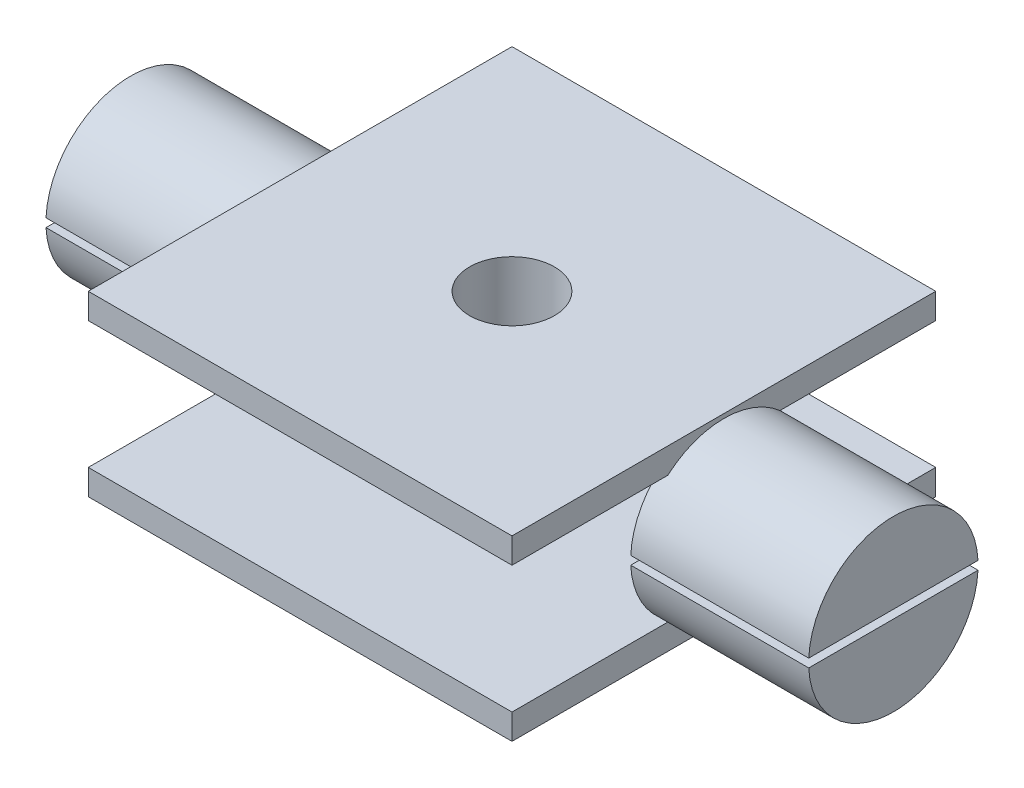
ISO-10303-21;
HEADER;
FILE_DESCRIPTION(('STEP AP214'),'2;1');
FILE_NAME('part.step','',(''),(''),'','','');
FILE_SCHEMA(('AUTOMOTIVE_DESIGN { 1 0 10303 214 1 1 1 1 }'));
ENDSEC;
DATA;
#1=APPLICATION_CONTEXT('core data for automotive mechanical design processes');
#2=APPLICATION_PROTOCOL_DEFINITION('international standard','automotive_design',2000,#1);
#3=PRODUCT_CONTEXT('',#1,'mechanical');
#4=PRODUCT('Part','Part','',(#3));
#5=PRODUCT_RELATED_PRODUCT_CATEGORY('part','',(#4));
#6=PRODUCT_DEFINITION_FORMATION('','',#4);
#7=PRODUCT_DEFINITION_CONTEXT('part definition',#1,'design');
#8=PRODUCT_DEFINITION('design','',#6,#7);
#9=PRODUCT_DEFINITION_SHAPE('','',#8);
#10=(LENGTH_UNIT() NAMED_UNIT(*) SI_UNIT(.MILLI.,.METRE.));
#11=(NAMED_UNIT(*) PLANE_ANGLE_UNIT() SI_UNIT($,.RADIAN.));
#12=(NAMED_UNIT(*) SI_UNIT($,.STERADIAN.) SOLID_ANGLE_UNIT());
#13=UNCERTAINTY_MEASURE_WITH_UNIT(LENGTH_MEASURE(1.E-05),#10,'distance_accuracy_value','');
#14=(GEOMETRIC_REPRESENTATION_CONTEXT(3) GLOBAL_UNCERTAINTY_ASSIGNED_CONTEXT((#13)) GLOBAL_UNIT_ASSIGNED_CONTEXT((#10,
#11,#12)) REPRESENTATION_CONTEXT('',''));
#15=CARTESIAN_POINT('',(0.,0.,0.));
#16=DIRECTION('',(0.,0.,1.));
#17=DIRECTION('',(1.,0.,0.));
#18=AXIS2_PLACEMENT_3D('',#15,#16,#17);
#19=CARTESIAN_POINT('',(0.,15.,0.));
#20=DIRECTION('',(0.,-1.,0.));
#21=DIRECTION('',(0.,0.,-1.));
#22=AXIS2_PLACEMENT_3D('',#19,#20,#21);
#23=CYLINDRICAL_SURFACE('',#22,10.);
#24=CARTESIAN_POINT('',(0.,0.,0.));
#25=DIRECTION('',(0.,1.,0.));
#26=DIRECTION('',(0.,0.,1.));
#27=AXIS2_PLACEMENT_3D('',#24,#25,#26);
#28=CIRCLE('',#27,10.);
#29=CARTESIAN_POINT('',(0.,0.,10.));
#30=VERTEX_POINT('',#29);
#31=EDGE_CURVE('E374',#30,#30,#28,.T.);
#32=ORIENTED_EDGE('',*,*,#31,.T.);
#33=EDGE_LOOP('',(#32));
#34=FACE_BOUND('',#33,.T.);
#35=CARTESIAN_POINT('',(0.,15.,0.));
#36=DIRECTION('',(0.,1.,0.));
#37=DIRECTION('',(0.,0.,1.));
#38=AXIS2_PLACEMENT_3D('',#35,#36,#37);
#39=CIRCLE('',#38,10.);
#40=CARTESIAN_POINT('',(0.,15.,10.));
#41=VERTEX_POINT('',#40);
#42=EDGE_CURVE('E375',#41,#41,#39,.T.);
#43=ORIENTED_EDGE('',*,*,#42,.F.);
#44=EDGE_LOOP('',(#43));
#45=FACE_BOUND('',#44,.T.);
#46=ADVANCED_FACE('F38',(#34,#45),#23,.T.);
#47=CARTESIAN_POINT('',(-25.,-3.,25.));
#48=DIRECTION('',(0.,0.,-1.));
#49=DIRECTION('',(-1.,0.,0.));
#50=AXIS2_PLACEMENT_3D('',#47,#48,#49);
#51=PLANE('',#50);
#52=DIRECTION('',(-1.,0.,0.));
#53=VECTOR('',#52,1.);
#54=CARTESIAN_POINT('',(-25.,-3.,25.));
#55=LINE('',#54,#53);
#56=CARTESIAN_POINT('',(25.,-3.,25.));
#57=VERTEX_POINT('',#56);
#58=CARTESIAN_POINT('',(-25.,-3.,25.));
#59=VERTEX_POINT('',#58);
#60=EDGE_CURVE('E355',#57,#59,#55,.T.);
#61=ORIENTED_EDGE('',*,*,#60,.F.);
#62=DIRECTION('',(0.,1.,0.));
#63=VECTOR('',#62,1.);
#64=CARTESIAN_POINT('',(25.,-3.,25.));
#65=LINE('',#64,#63);
#66=CARTESIAN_POINT('',(25.,0.,25.));
#67=VERTEX_POINT('',#66);
#68=EDGE_CURVE('E518',#57,#67,#65,.T.);
#69=ORIENTED_EDGE('',*,*,#68,.T.);
#70=DIRECTION('',(-1.,0.,0.));
#71=VECTOR('',#70,1.);
#72=CARTESIAN_POINT('',(-25.,0.,25.));
#73=LINE('',#72,#71);
#74=CARTESIAN_POINT('',(-25.,0.,25.));
#75=VERTEX_POINT('',#74);
#76=EDGE_CURVE('E354',#67,#75,#73,.T.);
#77=ORIENTED_EDGE('',*,*,#76,.T.);
#78=DIRECTION('',(0.,1.,0.));
#79=VECTOR('',#78,1.);
#80=CARTESIAN_POINT('',(-25.,-3.,25.));
#81=LINE('',#80,#79);
#82=EDGE_CURVE('E371',#59,#75,#81,.T.);
#83=ORIENTED_EDGE('',*,*,#82,.F.);
#84=EDGE_LOOP('',(#61,#69,#77,#83));
#85=FACE_BOUND('',#84,.T.);
#86=ADVANCED_FACE('F424',(#85),#51,.F.);
#87=CARTESIAN_POINT('',(-25.,-3.,-25.));
#88=DIRECTION('',(0.,0.,1.));
#89=DIRECTION('',(1.,0.,0.));
#90=AXIS2_PLACEMENT_3D('',#87,#88,#89);
#91=PLANE('',#90);
#92=DIRECTION('',(1.,0.,0.));
#93=VECTOR('',#92,1.);
#94=CARTESIAN_POINT('',(-25.,0.,-25.));
#95=LINE('',#94,#93);
#96=CARTESIAN_POINT('',(-25.,0.,-25.));
#97=VERTEX_POINT('',#96);
#98=CARTESIAN_POINT('',(25.,0.,-25.));
#99=VERTEX_POINT('',#98);
#100=EDGE_CURVE('E358',#97,#99,#95,.T.);
#101=ORIENTED_EDGE('',*,*,#100,.T.);
#102=DIRECTION('',(0.,1.,0.));
#103=VECTOR('',#102,1.);
#104=CARTESIAN_POINT('',(25.,-3.,-25.));
#105=LINE('',#104,#103);
#106=CARTESIAN_POINT('',(25.,-3.,-25.));
#107=VERTEX_POINT('',#106);
#108=EDGE_CURVE('E508',#107,#99,#105,.T.);
#109=ORIENTED_EDGE('',*,*,#108,.F.);
#110=DIRECTION('',(1.,0.,0.));
#111=VECTOR('',#110,1.);
#112=CARTESIAN_POINT('',(-25.,-3.,-25.));
#113=LINE('',#112,#111);
#114=CARTESIAN_POINT('',(-25.,-3.,-25.));
#115=VERTEX_POINT('',#114);
#116=EDGE_CURVE('E360',#115,#107,#113,.T.);
#117=ORIENTED_EDGE('',*,*,#116,.F.);
#118=DIRECTION('',(0.,1.,0.));
#119=VECTOR('',#118,1.);
#120=CARTESIAN_POINT('',(-25.,-3.,-25.));
#121=LINE('',#120,#119);
#122=EDGE_CURVE('E362',#115,#97,#121,.T.);
#123=ORIENTED_EDGE('',*,*,#122,.T.);
#124=EDGE_LOOP('',(#101,#109,#117,#123));
#125=FACE_BOUND('',#124,.T.);
#126=ADVANCED_FACE('F429',(#125),#91,.F.);
#127=CARTESIAN_POINT('',(0.,-3.,0.));
#128=DIRECTION('',(0.,1.,0.));
#129=DIRECTION('',(0.,0.,1.));
#130=AXIS2_PLACEMENT_3D('',#127,#128,#129);
#131=PLANE('',#130);
#132=CARTESIAN_POINT('',(0.,-3.,0.));
#133=DIRECTION('',(0.,1.,0.));
#134=DIRECTION('',(0.,0.,1.));
#135=AXIS2_PLACEMENT_3D('',#132,#133,#134);
#136=CIRCLE('',#135,5.);
#137=CARTESIAN_POINT('',(0.,-3.,5.));
#138=VERTEX_POINT('',#137);
#139=EDGE_CURVE('E293',#138,#138,#136,.T.);
#140=ORIENTED_EDGE('',*,*,#139,.T.);
#141=EDGE_LOOP('',(#140));
#142=FACE_BOUND('',#141,.T.);
#143=DIRECTION('',(0.,0.,-1.));
#144=VECTOR('',#143,1.);
#145=CARTESIAN_POINT('',(25.,-3.,-25.));
#146=LINE('',#145,#144);
#147=EDGE_CURVE('E512',#57,#107,#146,.T.);
#148=ORIENTED_EDGE('',*,*,#147,.F.);
#149=ORIENTED_EDGE('',*,*,#60,.T.);
#150=DIRECTION('',(0.,0.,-1.));
#151=VECTOR('',#150,1.);
#152=CARTESIAN_POINT('',(-25.,-3.,-25.));
#153=LINE('',#152,#151);
#154=EDGE_CURVE('E357',#59,#115,#153,.T.);
#155=ORIENTED_EDGE('',*,*,#154,.T.);
#156=ORIENTED_EDGE('',*,*,#116,.T.);
#157=EDGE_LOOP('',(#148,#149,#155,#156));
#158=FACE_BOUND('',#157,.T.);
#159=ADVANCED_FACE('F468',(#142,#158),#131,.F.);
#160=CARTESIAN_POINT('',(0.,0.,0.));
#161=DIRECTION('',(0.,1.,0.));
#162=DIRECTION('',(0.,0.,1.));
#163=AXIS2_PLACEMENT_3D('',#160,#161,#162);
#164=PLANE('',#163);
#165=ORIENTED_EDGE('',*,*,#31,.F.);
#166=EDGE_LOOP('',(#165));
#167=FACE_BOUND('',#166,.T.);
#168=ORIENTED_EDGE('',*,*,#76,.F.);
#169=DIRECTION('',(0.,0.,-1.));
#170=VECTOR('',#169,1.);
#171=CARTESIAN_POINT('',(25.,0.,-25.));
#172=LINE('',#171,#170);
#173=CARTESIAN_POINT('',(25.,0.,6.61437827766148));
#174=VERTEX_POINT('',#173);
#175=EDGE_CURVE('E519',#67,#174,#172,.T.);
#176=ORIENTED_EDGE('',*,*,#175,.T.);
#177=DIRECTION('',(1.,0.,0.));
#178=VECTOR('',#177,1.);
#179=CARTESIAN_POINT('',(24.,0.,6.61437827766148));
#180=LINE('',#179,#178);
#181=CARTESIAN_POINT('',(24.,0.,6.61437827766148));
#182=VERTEX_POINT('',#181);
#183=EDGE_CURVE('E578',#174,#182,#180,.F.);
#184=ORIENTED_EDGE('',*,*,#183,.T.);
#185=DIRECTION('',(0.,0.,1.));
#186=VECTOR('',#185,1.);
#187=CARTESIAN_POINT('',(24.,0.,0.));
#188=LINE('',#187,#186);
#189=CARTESIAN_POINT('',(24.,0.,-6.61437827766148));
#190=VERTEX_POINT('',#189);
#191=EDGE_CURVE('E573',#190,#182,#188,.T.);
#192=ORIENTED_EDGE('',*,*,#191,.F.);
#193=DIRECTION('',(1.,0.,0.));
#194=VECTOR('',#193,1.);
#195=CARTESIAN_POINT('',(24.,0.,-6.61437827766148));
#196=LINE('',#195,#194);
#197=CARTESIAN_POINT('',(25.,0.,-6.61437827766148));
#198=VERTEX_POINT('',#197);
#199=EDGE_CURVE('E583',#190,#198,#196,.T.);
#200=ORIENTED_EDGE('',*,*,#199,.T.);
#201=EDGE_CURVE('E522',#198,#99,#172,.T.);
#202=ORIENTED_EDGE('',*,*,#201,.T.);
#203=ORIENTED_EDGE('',*,*,#100,.F.);
#204=DIRECTION('',(0.,0.,-1.));
#205=VECTOR('',#204,1.);
#206=CARTESIAN_POINT('',(-25.,0.,-25.));
#207=LINE('',#206,#205);
#208=CARTESIAN_POINT('',(-25.,0.,-6.61437827766148));
#209=VERTEX_POINT('',#208);
#210=EDGE_CURVE('E364',#209,#97,#207,.T.);
#211=ORIENTED_EDGE('',*,*,#210,.F.);
#212=DIRECTION('',(-1.,0.,0.));
#213=VECTOR('',#212,1.);
#214=CARTESIAN_POINT('',(-24.,0.,-6.61437827766148));
#215=LINE('',#214,#213);
#216=CARTESIAN_POINT('',(-24.,0.,-6.61437827766148));
#217=VERTEX_POINT('',#216);
#218=EDGE_CURVE('E332',#217,#209,#215,.T.);
#219=ORIENTED_EDGE('',*,*,#218,.F.);
#220=DIRECTION('',(0.,0.,1.));
#221=VECTOR('',#220,1.);
#222=CARTESIAN_POINT('',(-24.,0.,0.));
#223=LINE('',#222,#221);
#224=CARTESIAN_POINT('',(-24.,0.,6.61437827766148));
#225=VERTEX_POINT('',#224);
#226=EDGE_CURVE('E320',#217,#225,#223,.T.);
#227=ORIENTED_EDGE('',*,*,#226,.T.);
#228=DIRECTION('',(-1.,0.,0.));
#229=VECTOR('',#228,1.);
#230=CARTESIAN_POINT('',(-24.,0.,6.61437827766148));
#231=LINE('',#230,#229);
#232=CARTESIAN_POINT('',(-25.,0.,6.61437827766148));
#233=VERTEX_POINT('',#232);
#234=EDGE_CURVE('E326',#233,#225,#231,.F.);
#235=ORIENTED_EDGE('',*,*,#234,.F.);
#236=EDGE_CURVE('E365',#75,#233,#207,.T.);
#237=ORIENTED_EDGE('',*,*,#236,.F.);
#238=EDGE_LOOP('',(#168,#176,#184,#192,#200,#202,#203,#211,#219,#227,#235,#237));
#239=FACE_BOUND('',#238,.T.);
#240=ADVANCED_FACE('F466',(#167,#239),#164,.T.);
#241=CARTESIAN_POINT('',(-25.,18.,-25.));
#242=DIRECTION('',(0.,0.,1.));
#243=DIRECTION('',(1.,0.,0.));
#244=AXIS2_PLACEMENT_3D('',#241,#242,#243);
#245=PLANE('',#244);
#246=DIRECTION('',(-1.,0.,0.));
#247=VECTOR('',#246,1.);
#248=CARTESIAN_POINT('',(-25.,18.,-25.));
#249=LINE('',#248,#247);
#250=CARTESIAN_POINT('',(25.,18.,-25.));
#251=VERTEX_POINT('',#250);
#252=CARTESIAN_POINT('',(-25.,18.,-25.));
#253=VERTEX_POINT('',#252);
#254=EDGE_CURVE('E335',#251,#253,#249,.T.);
#255=ORIENTED_EDGE('',*,*,#254,.F.);
#256=DIRECTION('',(0.,-1.,0.));
#257=VECTOR('',#256,1.);
#258=CARTESIAN_POINT('',(25.,18.,-25.));
#259=LINE('',#258,#257);
#260=CARTESIAN_POINT('',(25.,15.,-25.));
#261=VERTEX_POINT('',#260);
#262=EDGE_CURVE('E525',#251,#261,#259,.T.);
#263=ORIENTED_EDGE('',*,*,#262,.T.);
#264=DIRECTION('',(-1.,0.,0.));
#265=VECTOR('',#264,1.);
#266=CARTESIAN_POINT('',(-25.,15.,-25.));
#267=LINE('',#266,#265);
#268=CARTESIAN_POINT('',(-25.,15.,-25.));
#269=VERTEX_POINT('',#268);
#270=EDGE_CURVE('E334',#261,#269,#267,.T.);
#271=ORIENTED_EDGE('',*,*,#270,.T.);
#272=DIRECTION('',(0.,-1.,0.));
#273=VECTOR('',#272,1.);
#274=CARTESIAN_POINT('',(-25.,18.,-25.));
#275=LINE('',#274,#273);
#276=EDGE_CURVE('E351',#253,#269,#275,.T.);
#277=ORIENTED_EDGE('',*,*,#276,.F.);
#278=EDGE_LOOP('',(#255,#263,#271,#277));
#279=FACE_BOUND('',#278,.T.);
#280=ADVANCED_FACE('F456',(#279),#245,.F.);
#281=CARTESIAN_POINT('',(-25.,18.,25.));
#282=DIRECTION('',(0.,0.,-1.));
#283=DIRECTION('',(-1.,0.,0.));
#284=AXIS2_PLACEMENT_3D('',#281,#282,#283);
#285=PLANE('',#284);
#286=DIRECTION('',(1.,0.,0.));
#287=VECTOR('',#286,1.);
#288=CARTESIAN_POINT('',(-25.,15.,25.));
#289=LINE('',#288,#287);
#290=CARTESIAN_POINT('',(-25.,15.,25.));
#291=VERTEX_POINT('',#290);
#292=CARTESIAN_POINT('',(25.,15.,25.));
#293=VERTEX_POINT('',#292);
#294=EDGE_CURVE('E338',#291,#293,#289,.T.);
#295=ORIENTED_EDGE('',*,*,#294,.T.);
#296=DIRECTION('',(0.,-1.,0.));
#297=VECTOR('',#296,1.);
#298=CARTESIAN_POINT('',(25.,18.,25.));
#299=LINE('',#298,#297);
#300=CARTESIAN_POINT('',(25.,18.,25.));
#301=VERTEX_POINT('',#300);
#302=EDGE_CURVE('E590',#301,#293,#299,.T.);
#303=ORIENTED_EDGE('',*,*,#302,.F.);
#304=DIRECTION('',(1.,0.,0.));
#305=VECTOR('',#304,1.);
#306=CARTESIAN_POINT('',(-25.,18.,25.));
#307=LINE('',#306,#305);
#308=CARTESIAN_POINT('',(-25.,18.,25.));
#309=VERTEX_POINT('',#308);
#310=EDGE_CURVE('E340',#309,#301,#307,.T.);
#311=ORIENTED_EDGE('',*,*,#310,.F.);
#312=DIRECTION('',(0.,-1.,0.));
#313=VECTOR('',#312,1.);
#314=CARTESIAN_POINT('',(-25.,18.,25.));
#315=LINE('',#314,#313);
#316=EDGE_CURVE('E342',#309,#291,#315,.T.);
#317=ORIENTED_EDGE('',*,*,#316,.T.);
#318=EDGE_LOOP('',(#295,#303,#311,#317));
#319=FACE_BOUND('',#318,.T.);
#320=ADVANCED_FACE('F448',(#319),#285,.F.);
#321=CARTESIAN_POINT('',(0.,18.,0.));
#322=DIRECTION('',(0.,-1.,0.));
#323=DIRECTION('',(0.,0.,-1.));
#324=AXIS2_PLACEMENT_3D('',#321,#322,#323);
#325=PLANE('',#324);
#326=ORIENTED_EDGE('',*,*,#310,.T.);
#327=DIRECTION('',(0.,0.,1.));
#328=VECTOR('',#327,1.);
#329=CARTESIAN_POINT('',(25.,18.,25.));
#330=LINE('',#329,#328);
#331=EDGE_CURVE('E587',#251,#301,#330,.T.);
#332=ORIENTED_EDGE('',*,*,#331,.F.);
#333=ORIENTED_EDGE('',*,*,#254,.T.);
#334=DIRECTION('',(0.,0.,1.));
#335=VECTOR('',#334,1.);
#336=CARTESIAN_POINT('',(-25.,18.,25.));
#337=LINE('',#336,#335);
#338=EDGE_CURVE('E337',#253,#309,#337,.T.);
#339=ORIENTED_EDGE('',*,*,#338,.T.);
#340=EDGE_LOOP('',(#326,#332,#333,#339));
#341=FACE_BOUND('',#340,.T.);
#342=CARTESIAN_POINT('',(0.,18.,0.));
#343=DIRECTION('',(0.,1.,0.));
#344=DIRECTION('',(0.,0.,1.));
#345=AXIS2_PLACEMENT_3D('',#342,#343,#344);
#346=CIRCLE('',#345,5.);
#347=CARTESIAN_POINT('',(0.,18.,5.));
#348=VERTEX_POINT('',#347);
#349=EDGE_CURVE('E292',#348,#348,#346,.T.);
#350=ORIENTED_EDGE('',*,*,#349,.F.);
#351=EDGE_LOOP('',(#350));
#352=FACE_BOUND('',#351,.T.);
#353=ADVANCED_FACE('F438',(#341,#352),#325,.F.);
#354=CARTESIAN_POINT('',(0.,15.,0.));
#355=DIRECTION('',(0.,-1.,0.));
#356=DIRECTION('',(0.,0.,-1.));
#357=AXIS2_PLACEMENT_3D('',#354,#355,#356);
#358=PLANE('',#357);
#359=DIRECTION('',(0.,0.,1.));
#360=VECTOR('',#359,1.);
#361=CARTESIAN_POINT('',(25.,15.,25.));
#362=LINE('',#361,#360);
#363=CARTESIAN_POINT('',(25.,15.,6.61437827766148));
#364=VERTEX_POINT('',#363);
#365=EDGE_CURVE('E586',#364,#293,#362,.T.);
#366=ORIENTED_EDGE('',*,*,#365,.T.);
#367=ORIENTED_EDGE('',*,*,#294,.F.);
#368=DIRECTION('',(0.,0.,1.));
#369=VECTOR('',#368,1.);
#370=CARTESIAN_POINT('',(-25.,15.,25.));
#371=LINE('',#370,#369);
#372=CARTESIAN_POINT('',(-25.,15.,6.61437827766148));
#373=VERTEX_POINT('',#372);
#374=EDGE_CURVE('E344',#373,#291,#371,.T.);
#375=ORIENTED_EDGE('',*,*,#374,.F.);
#376=DIRECTION('',(-1.,0.,0.));
#377=VECTOR('',#376,1.);
#378=CARTESIAN_POINT('',(-24.,15.,6.61437827766148));
#379=LINE('',#378,#377);
#380=CARTESIAN_POINT('',(-24.,15.,6.61437827766148));
#381=VERTEX_POINT('',#380);
#382=EDGE_CURVE('E386',#381,#373,#379,.T.);
#383=ORIENTED_EDGE('',*,*,#382,.F.);
#384=DIRECTION('',(0.,0.,-1.));
#385=VECTOR('',#384,1.);
#386=CARTESIAN_POINT('',(-24.,15.,0.));
#387=LINE('',#386,#385);
#388=CARTESIAN_POINT('',(-24.,15.,-6.61437827766148));
#389=VERTEX_POINT('',#388);
#390=EDGE_CURVE('E378',#381,#389,#387,.T.);
#391=ORIENTED_EDGE('',*,*,#390,.T.);
#392=DIRECTION('',(-1.,0.,0.));
#393=VECTOR('',#392,1.);
#394=CARTESIAN_POINT('',(-24.,15.,-6.61437827766148));
#395=LINE('',#394,#393);
#396=CARTESIAN_POINT('',(-25.,15.,-6.61437827766148));
#397=VERTEX_POINT('',#396);
#398=EDGE_CURVE('E383',#397,#389,#395,.F.);
#399=ORIENTED_EDGE('',*,*,#398,.F.);
#400=EDGE_CURVE('E345',#269,#397,#371,.T.);
#401=ORIENTED_EDGE('',*,*,#400,.F.);
#402=ORIENTED_EDGE('',*,*,#270,.F.);
#403=CARTESIAN_POINT('',(25.,15.,-6.61437827766148));
#404=VERTEX_POINT('',#403);
#405=EDGE_CURVE('E591',#261,#404,#362,.T.);
#406=ORIENTED_EDGE('',*,*,#405,.T.);
#407=DIRECTION('',(1.,0.,0.));
#408=VECTOR('',#407,1.);
#409=CARTESIAN_POINT('',(24.,15.,-6.61437827766148));
#410=LINE('',#409,#408);
#411=CARTESIAN_POINT('',(24.,15.,-6.61437827766148));
#412=VERTEX_POINT('',#411);
#413=EDGE_CURVE('E532',#404,#412,#410,.F.);
#414=ORIENTED_EDGE('',*,*,#413,.T.);
#415=DIRECTION('',(0.,0.,-1.));
#416=VECTOR('',#415,1.);
#417=CARTESIAN_POINT('',(24.,15.,0.));
#418=LINE('',#417,#416);
#419=CARTESIAN_POINT('',(24.,15.,6.61437827766148));
#420=VERTEX_POINT('',#419);
#421=EDGE_CURVE('E529',#420,#412,#418,.T.);
#422=ORIENTED_EDGE('',*,*,#421,.F.);
#423=DIRECTION('',(1.,0.,0.));
#424=VECTOR('',#423,1.);
#425=CARTESIAN_POINT('',(24.,15.,6.61437827766148));
#426=LINE('',#425,#424);
#427=EDGE_CURVE('E535',#420,#364,#426,.T.);
#428=ORIENTED_EDGE('',*,*,#427,.T.);
#429=EDGE_LOOP('',(#366,#367,#375,#383,#391,#399,#401,#402,#406,#414,#422,#428));
#430=FACE_BOUND('',#429,.T.);
#431=ORIENTED_EDGE('',*,*,#42,.T.);
#432=EDGE_LOOP('',(#431));
#433=FACE_BOUND('',#432,.T.);
#434=ADVANCED_FACE('F435',(#430,#433),#358,.T.);
#435=CARTESIAN_POINT('',(0.,-3.,0.));
#436=DIRECTION('',(0.,1.,0.));
#437=DIRECTION('',(0.,0.,1.));
#438=AXIS2_PLACEMENT_3D('',#435,#436,#437);
#439=CYLINDRICAL_SURFACE('',#438,5.);
#440=ORIENTED_EDGE('',*,*,#349,.T.);
#441=EDGE_LOOP('',(#440));
#442=FACE_BOUND('',#441,.T.);
#443=ORIENTED_EDGE('',*,*,#139,.F.);
#444=EDGE_LOOP('',(#443));
#445=FACE_BOUND('',#444,.T.);
#446=ADVANCED_FACE('F437',(#442,#445),#439,.F.);
#447=CARTESIAN_POINT('',(-24.,7.5,0.));
#448=DIRECTION('',(-1.,0.,0.));
#449=DIRECTION('',(0.,0.,1.));
#450=AXIS2_PLACEMENT_3D('',#447,#448,#449);
#451=CYLINDRICAL_SURFACE('',#450,10.);
#452=DIRECTION('',(-1.,0.,0.));
#453=VECTOR('',#452,1.);
#454=CARTESIAN_POINT('',(-24.,7.,9.98749217771909));
#455=LINE('',#454,#453);
#456=CARTESIAN_POINT('',(-45.,7.,9.98749217771909));
#457=VERTEX_POINT('',#456);
#458=CARTESIAN_POINT('',(-24.,7.,9.98749217771909));
#459=VERTEX_POINT('',#458);
#460=EDGE_CURVE('E308',#457,#459,#455,.F.);
#461=ORIENTED_EDGE('',*,*,#460,.F.);
#462=CARTESIAN_POINT('',(-45.,7.5,0.));
#463=DIRECTION('',(-1.,0.,0.));
#464=DIRECTION('',(0.,0.,1.));
#465=AXIS2_PLACEMENT_3D('',#462,#463,#464);
#466=CIRCLE('',#465,10.);
#467=CARTESIAN_POINT('',(-45.,7.,-9.98749217771909));
#468=VERTEX_POINT('',#467);
#469=EDGE_CURVE('E310',#468,#457,#466,.T.);
#470=ORIENTED_EDGE('',*,*,#469,.F.);
#471=DIRECTION('',(-1.,0.,0.));
#472=VECTOR('',#471,1.);
#473=CARTESIAN_POINT('',(-24.,7.,-9.98749217771909));
#474=LINE('',#473,#472);
#475=CARTESIAN_POINT('',(-24.,7.,-9.98749217771909));
#476=VERTEX_POINT('',#475);
#477=EDGE_CURVE('E306',#476,#468,#474,.T.);
#478=ORIENTED_EDGE('',*,*,#477,.F.);
#479=CARTESIAN_POINT('',(-24.,7.5,0.));
#480=DIRECTION('',(-1.,0.,0.));
#481=DIRECTION('',(0.,0.,1.));
#482=AXIS2_PLACEMENT_3D('',#479,#480,#481);
#483=CIRCLE('',#482,10.);
#484=EDGE_CURVE('E318',#476,#217,#483,.T.);
#485=ORIENTED_EDGE('',*,*,#484,.T.);
#486=ORIENTED_EDGE('',*,*,#218,.T.);
#487=CARTESIAN_POINT('',(-25.,7.5,0.));
#488=DIRECTION('',(1.,0.,0.));
#489=DIRECTION('',(0.,0.,-1.));
#490=AXIS2_PLACEMENT_3D('',#487,#488,#489);
#491=CIRCLE('',#490,10.);
#492=EDGE_CURVE('E329',#233,#209,#491,.T.);
#493=ORIENTED_EDGE('',*,*,#492,.F.);
#494=ORIENTED_EDGE('',*,*,#234,.T.);
#495=EDGE_CURVE('E315',#225,#459,#483,.T.);
#496=ORIENTED_EDGE('',*,*,#495,.T.);
#497=EDGE_LOOP('',(#461,#470,#478,#485,#486,#493,#494,#496));
#498=FACE_BOUND('',#497,.T.);
#499=ADVANCED_FACE('F445',(#498),#451,.T.);
#500=CARTESIAN_POINT('',(-24.,7.5,0.));
#501=DIRECTION('',(-1.,0.,0.));
#502=DIRECTION('',(0.,0.,1.));
#503=AXIS2_PLACEMENT_3D('',#500,#501,#502);
#504=PLANE('',#503);
#505=ORIENTED_EDGE('',*,*,#484,.F.);
#506=DIRECTION('',(0.,0.,-1.));
#507=VECTOR('',#506,1.);
#508=CARTESIAN_POINT('',(-24.,7.,-14.4827544881991));
#509=LINE('',#508,#507);
#510=EDGE_CURVE('E296',#459,#476,#509,.T.);
#511=ORIENTED_EDGE('',*,*,#510,.F.);
#512=ORIENTED_EDGE('',*,*,#495,.F.);
#513=ORIENTED_EDGE('',*,*,#226,.F.);
#514=EDGE_LOOP('',(#505,#511,#512,#513));
#515=FACE_BOUND('',#514,.T.);
#516=ADVANCED_FACE('F484',(#515),#504,.F.);
#517=CARTESIAN_POINT('',(-45.,7.5,0.));
#518=DIRECTION('',(-1.,0.,0.));
#519=DIRECTION('',(0.,0.,1.));
#520=AXIS2_PLACEMENT_3D('',#517,#518,#519);
#521=PLANE('',#520);
#522=DIRECTION('',(0.,0.,1.));
#523=VECTOR('',#522,1.);
#524=CARTESIAN_POINT('',(-45.,7.,0.));
#525=LINE('',#524,#523);
#526=EDGE_CURVE('E390',#468,#457,#525,.T.);
#527=ORIENTED_EDGE('',*,*,#526,.F.);
#528=ORIENTED_EDGE('',*,*,#469,.T.);
#529=EDGE_LOOP('',(#527,#528));
#530=FACE_BOUND('',#529,.T.);
#531=ADVANCED_FACE('F479',(#530),#521,.T.);
#532=CARTESIAN_POINT('',(-25.,-3.,-25.));
#533=DIRECTION('',(1.,0.,0.));
#534=DIRECTION('',(0.,0.,-1.));
#535=AXIS2_PLACEMENT_3D('',#532,#533,#534);
#536=PLANE('',#535);
#537=ORIENTED_EDGE('',*,*,#236,.T.);
#538=ORIENTED_EDGE('',*,*,#492,.T.);
#539=ORIENTED_EDGE('',*,*,#210,.T.);
#540=ORIENTED_EDGE('',*,*,#122,.F.);
#541=ORIENTED_EDGE('',*,*,#154,.F.);
#542=ORIENTED_EDGE('',*,*,#82,.T.);
#543=EDGE_LOOP('',(#537,#538,#539,#540,#541,#542));
#544=FACE_BOUND('',#543,.T.);
#545=ADVANCED_FACE('F462',(#544),#536,.F.);
#546=CARTESIAN_POINT('',(-25.,18.,25.));
#547=DIRECTION('',(1.,0.,0.));
#548=DIRECTION('',(0.,0.,-1.));
#549=AXIS2_PLACEMENT_3D('',#546,#547,#548);
#550=PLANE('',#549);
#551=ORIENTED_EDGE('',*,*,#400,.T.);
#552=CARTESIAN_POINT('',(-25.,7.5,0.));
#553=DIRECTION('',(1.,0.,0.));
#554=DIRECTION('',(0.,0.,-1.));
#555=AXIS2_PLACEMENT_3D('',#552,#553,#554);
#556=CIRCLE('',#555,10.);
#557=EDGE_CURVE('E323',#397,#373,#556,.T.);
#558=ORIENTED_EDGE('',*,*,#557,.T.);
#559=ORIENTED_EDGE('',*,*,#374,.T.);
#560=ORIENTED_EDGE('',*,*,#316,.F.);
#561=ORIENTED_EDGE('',*,*,#338,.F.);
#562=ORIENTED_EDGE('',*,*,#276,.T.);
#563=EDGE_LOOP('',(#551,#558,#559,#560,#561,#562));
#564=FACE_BOUND('',#563,.T.);
#565=ADVANCED_FACE('F458',(#564),#550,.F.);
#566=DIRECTION('',(-1.,0.,0.));
#567=VECTOR('',#566,1.);
#568=CARTESIAN_POINT('',(-24.,8.,-9.98749217771909));
#569=LINE('',#568,#567);
#570=CARTESIAN_POINT('',(-45.,8.,-9.98749217771909));
#571=VERTEX_POINT('',#570);
#572=CARTESIAN_POINT('',(-24.,8.,-9.98749217771909));
#573=VERTEX_POINT('',#572);
#574=EDGE_CURVE('E304',#571,#573,#569,.F.);
#575=ORIENTED_EDGE('',*,*,#574,.F.);
#576=CARTESIAN_POINT('',(-45.,8.,9.98749217771909));
#577=VERTEX_POINT('',#576);
#578=EDGE_CURVE('E311',#577,#571,#466,.T.);
#579=ORIENTED_EDGE('',*,*,#578,.F.);
#580=DIRECTION('',(-1.,0.,0.));
#581=VECTOR('',#580,1.);
#582=CARTESIAN_POINT('',(-24.,8.,9.98749217771909));
#583=LINE('',#582,#581);
#584=CARTESIAN_POINT('',(-24.,8.,9.98749217771909));
#585=VERTEX_POINT('',#584);
#586=EDGE_CURVE('E302',#585,#577,#583,.T.);
#587=ORIENTED_EDGE('',*,*,#586,.F.);
#588=EDGE_CURVE('E314',#585,#381,#483,.T.);
#589=ORIENTED_EDGE('',*,*,#588,.T.);
#590=ORIENTED_EDGE('',*,*,#382,.T.);
#591=ORIENTED_EDGE('',*,*,#557,.F.);
#592=ORIENTED_EDGE('',*,*,#398,.T.);
#593=EDGE_CURVE('E319',#389,#573,#483,.T.);
#594=ORIENTED_EDGE('',*,*,#593,.T.);
#595=EDGE_LOOP('',(#575,#579,#587,#589,#590,#591,#592,#594));
#596=FACE_BOUND('',#595,.T.);
#597=ADVANCED_FACE('F461',(#596),#451,.T.);
#598=ORIENTED_EDGE('',*,*,#588,.F.);
#599=DIRECTION('',(0.,0.,1.));
#600=VECTOR('',#599,1.);
#601=CARTESIAN_POINT('',(-24.,8.,-14.4827544881991));
#602=LINE('',#601,#600);
#603=EDGE_CURVE('E300',#573,#585,#602,.T.);
#604=ORIENTED_EDGE('',*,*,#603,.F.);
#605=ORIENTED_EDGE('',*,*,#593,.F.);
#606=ORIENTED_EDGE('',*,*,#390,.F.);
#607=EDGE_LOOP('',(#598,#604,#605,#606));
#608=FACE_BOUND('',#607,.T.);
#609=ADVANCED_FACE('F630',(#608),#504,.F.);
#610=DIRECTION('',(0.,0.,-1.));
#611=VECTOR('',#610,1.);
#612=CARTESIAN_POINT('',(-45.,8.,0.));
#613=LINE('',#612,#611);
#614=EDGE_CURVE('E388',#577,#571,#613,.T.);
#615=ORIENTED_EDGE('',*,*,#614,.F.);
#616=ORIENTED_EDGE('',*,*,#578,.T.);
#617=EDGE_LOOP('',(#615,#616));
#618=FACE_BOUND('',#617,.T.);
#619=ADVANCED_FACE('F487',(#618),#521,.T.);
#620=CARTESIAN_POINT('',(4.9827657455566,8.,-14.4827544881991));
#621=DIRECTION('',(0.,1.,0.));
#622=DIRECTION('',(0.,0.,1.));
#623=AXIS2_PLACEMENT_3D('',#620,#621,#622);
#624=PLANE('',#623);
#625=DIRECTION('',(-1.,0.,0.));
#626=VECTOR('',#625,1.);
#627=CARTESIAN_POINT('',(-1.37258300203048,8.,-7.98435971133565));
#628=LINE('',#627,#626);
#629=CARTESIAN_POINT('',(-26.,8.,-7.98435971133565));
#630=VERTEX_POINT('',#629);
#631=CARTESIAN_POINT('',(-43.,8.,-7.98435971133565));
#632=VERTEX_POINT('',#631);
#633=EDGE_CURVE('E289',#630,#632,#628,.T.);
#634=ORIENTED_EDGE('',*,*,#633,.T.);
#635=DIRECTION('',(0.,0.,1.));
#636=VECTOR('',#635,1.);
#637=CARTESIAN_POINT('',(-43.,8.,-14.4827544881991));
#638=LINE('',#637,#636);
#639=CARTESIAN_POINT('',(-43.,8.,7.98435971133565));
#640=VERTEX_POINT('',#639);
#641=EDGE_CURVE('E283',#632,#640,#638,.T.);
#642=ORIENTED_EDGE('',*,*,#641,.T.);
#643=DIRECTION('',(-1.,0.,0.));
#644=VECTOR('',#643,1.);
#645=CARTESIAN_POINT('',(-1.37258300203048,8.,7.98435971133565));
#646=LINE('',#645,#644);
#647=CARTESIAN_POINT('',(-26.,8.,7.98435971133565));
#648=VERTEX_POINT('',#647);
#649=EDGE_CURVE('E286',#640,#648,#646,.F.);
#650=ORIENTED_EDGE('',*,*,#649,.T.);
#651=DIRECTION('',(0.,0.,1.));
#652=VECTOR('',#651,1.);
#653=CARTESIAN_POINT('',(-26.,8.,-14.4827544881991));
#654=LINE('',#653,#652);
#655=EDGE_CURVE('E281',#630,#648,#654,.T.);
#656=ORIENTED_EDGE('',*,*,#655,.F.);
#657=EDGE_LOOP('',(#634,#642,#650,#656));
#658=FACE_BOUND('',#657,.T.);
#659=ORIENTED_EDGE('',*,*,#574,.T.);
#660=ORIENTED_EDGE('',*,*,#603,.T.);
#661=ORIENTED_EDGE('',*,*,#586,.T.);
#662=ORIENTED_EDGE('',*,*,#614,.T.);
#663=EDGE_LOOP('',(#659,#660,#661,#662));
#664=FACE_BOUND('',#663,.T.);
#665=ADVANCED_FACE('F417',(#658,#664),#624,.F.);
#666=CARTESIAN_POINT('',(4.9827657455566,7.,-14.4827544881991));
#667=DIRECTION('',(0.,-1.,0.));
#668=DIRECTION('',(0.,0.,-1.));
#669=AXIS2_PLACEMENT_3D('',#666,#667,#668);
#670=PLANE('',#669);
#671=DIRECTION('',(-1.,0.,0.));
#672=VECTOR('',#671,1.);
#673=CARTESIAN_POINT('',(-1.37258300203048,7.,7.98435971133565));
#674=LINE('',#673,#672);
#675=CARTESIAN_POINT('',(-26.,7.,7.98435971133565));
#676=VERTEX_POINT('',#675);
#677=CARTESIAN_POINT('',(-43.,7.,7.98435971133565));
#678=VERTEX_POINT('',#677);
#679=EDGE_CURVE('E45',#676,#678,#674,.T.);
#680=ORIENTED_EDGE('',*,*,#679,.T.);
#681=DIRECTION('',(0.,0.,-1.));
#682=VECTOR('',#681,1.);
#683=CARTESIAN_POINT('',(-43.,7.,-14.4827544881991));
#684=LINE('',#683,#682);
#685=CARTESIAN_POINT('',(-43.,7.,-7.98435971133565));
#686=VERTEX_POINT('',#685);
#687=EDGE_CURVE('E13',#678,#686,#684,.T.);
#688=ORIENTED_EDGE('',*,*,#687,.T.);
#689=DIRECTION('',(-1.,0.,0.));
#690=VECTOR('',#689,1.);
#691=CARTESIAN_POINT('',(-1.37258300203048,7.,-7.98435971133565));
#692=LINE('',#691,#690);
#693=CARTESIAN_POINT('',(-26.,7.,-7.98435971133565));
#694=VERTEX_POINT('',#693);
#695=EDGE_CURVE('E394',#686,#694,#692,.F.);
#696=ORIENTED_EDGE('',*,*,#695,.T.);
#697=DIRECTION('',(0.,0.,-1.));
#698=VECTOR('',#697,1.);
#699=CARTESIAN_POINT('',(-26.,7.,-14.4827544881991));
#700=LINE('',#699,#698);
#701=EDGE_CURVE('E392',#676,#694,#700,.T.);
#702=ORIENTED_EDGE('',*,*,#701,.F.);
#703=EDGE_LOOP('',(#680,#688,#696,#702));
#704=FACE_BOUND('',#703,.T.);
#705=ORIENTED_EDGE('',*,*,#460,.T.);
#706=ORIENTED_EDGE('',*,*,#510,.T.);
#707=ORIENTED_EDGE('',*,*,#477,.T.);
#708=ORIENTED_EDGE('',*,*,#526,.T.);
#709=EDGE_LOOP('',(#705,#706,#707,#708));
#710=FACE_BOUND('',#709,.T.);
#711=ADVANCED_FACE('F399',(#704,#710),#670,.F.);
#712=CARTESIAN_POINT('',(-43.,7.5,0.));
#713=DIRECTION('',(-1.,0.,0.));
#714=DIRECTION('',(0.,0.,1.));
#715=AXIS2_PLACEMENT_3D('',#712,#713,#714);
#716=PLANE('',#715);
#717=CARTESIAN_POINT('',(-43.,7.5,0.));
#718=DIRECTION('',(-1.,0.,0.));
#719=DIRECTION('',(0.,0.,1.));
#720=AXIS2_PLACEMENT_3D('',#717,#718,#719);
#721=CIRCLE('',#720,8.);
#722=EDGE_CURVE('E276',#686,#678,#721,.T.);
#723=ORIENTED_EDGE('',*,*,#722,.F.);
#724=ORIENTED_EDGE('',*,*,#687,.F.);
#725=EDGE_LOOP('',(#723,#724));
#726=FACE_BOUND('',#725,.T.);
#727=ADVANCED_FACE('F406',(#726),#716,.F.);
#728=CARTESIAN_POINT('',(-26.,7.5,0.));
#729=DIRECTION('',(-1.,0.,0.));
#730=DIRECTION('',(0.,0.,1.));
#731=AXIS2_PLACEMENT_3D('',#728,#729,#730);
#732=PLANE('',#731);
#733=ORIENTED_EDGE('',*,*,#701,.T.);
#734=CARTESIAN_POINT('',(-26.,7.5,0.));
#735=DIRECTION('',(-1.,0.,0.));
#736=DIRECTION('',(0.,0.,1.));
#737=AXIS2_PLACEMENT_3D('',#734,#735,#736);
#738=CIRCLE('',#737,8.);
#739=EDGE_CURVE('E58',#676,#694,#738,.F.);
#740=ORIENTED_EDGE('',*,*,#739,.F.);
#741=EDGE_LOOP('',(#733,#740));
#742=FACE_BOUND('',#741,.T.);
#743=ADVANCED_FACE('F408',(#742),#732,.T.);
#744=CARTESIAN_POINT('',(-1.37258300203048,7.5,0.));
#745=DIRECTION('',(-1.,0.,0.));
#746=DIRECTION('',(0.,0.,1.));
#747=AXIS2_PLACEMENT_3D('',#744,#745,#746);
#748=CYLINDRICAL_SURFACE('',#747,8.);
#749=ORIENTED_EDGE('',*,*,#739,.T.);
#750=ORIENTED_EDGE('',*,*,#695,.F.);
#751=ORIENTED_EDGE('',*,*,#722,.T.);
#752=ORIENTED_EDGE('',*,*,#679,.F.);
#753=EDGE_LOOP('',(#749,#750,#751,#752));
#754=FACE_BOUND('',#753,.T.);
#755=ADVANCED_FACE('F403',(#754),#748,.F.);
#756=EDGE_CURVE('E51',#630,#648,#738,.F.);
#757=ORIENTED_EDGE('',*,*,#756,.T.);
#758=ORIENTED_EDGE('',*,*,#649,.F.);
#759=EDGE_CURVE('E277',#640,#632,#721,.T.);
#760=ORIENTED_EDGE('',*,*,#759,.T.);
#761=ORIENTED_EDGE('',*,*,#633,.F.);
#762=EDGE_LOOP('',(#757,#758,#760,#761));
#763=FACE_BOUND('',#762,.T.);
#764=ADVANCED_FACE('F421',(#763),#748,.F.);
#765=ORIENTED_EDGE('',*,*,#759,.F.);
#766=ORIENTED_EDGE('',*,*,#641,.F.);
#767=EDGE_LOOP('',(#765,#766));
#768=FACE_BOUND('',#767,.T.);
#769=ADVANCED_FACE('F410',(#768),#716,.F.);
#770=ORIENTED_EDGE('',*,*,#655,.T.);
#771=ORIENTED_EDGE('',*,*,#756,.F.);
#772=EDGE_LOOP('',(#770,#771));
#773=FACE_BOUND('',#772,.T.);
#774=ADVANCED_FACE('F416',(#773),#732,.T.);
#775=CARTESIAN_POINT('',(24.,7.5,0.));
#776=DIRECTION('',(1.,0.,0.));
#777=DIRECTION('',(0.,0.,1.));
#778=AXIS2_PLACEMENT_3D('',#775,#776,#777);
#779=CYLINDRICAL_SURFACE('',#778,10.);
#780=DIRECTION('',(1.,0.,0.));
#781=VECTOR('',#780,1.);
#782=CARTESIAN_POINT('',(24.,7.,9.98749217771909));
#783=LINE('',#782,#781);
#784=CARTESIAN_POINT('',(45.,7.,9.98749217771909));
#785=VERTEX_POINT('',#784);
#786=CARTESIAN_POINT('',(24.,7.,9.98749217771909));
#787=VERTEX_POINT('',#786);
#788=EDGE_CURVE('E561',#785,#787,#783,.F.);
#789=ORIENTED_EDGE('',*,*,#788,.T.);
#790=CARTESIAN_POINT('',(24.,7.5,0.));
#791=DIRECTION('',(-1.,0.,0.));
#792=DIRECTION('',(0.,0.,1.));
#793=AXIS2_PLACEMENT_3D('',#790,#791,#792);
#794=CIRCLE('',#793,10.);
#795=EDGE_CURVE('E568',#182,#787,#794,.T.);
#796=ORIENTED_EDGE('',*,*,#795,.F.);
#797=ORIENTED_EDGE('',*,*,#183,.F.);
#798=CARTESIAN_POINT('',(25.,7.5,0.));
#799=DIRECTION('',(1.,0.,0.));
#800=DIRECTION('',(0.,0.,-1.));
#801=AXIS2_PLACEMENT_3D('',#798,#799,#800);
#802=CIRCLE('',#801,10.);
#803=EDGE_CURVE('E581',#174,#198,#802,.T.);
#804=ORIENTED_EDGE('',*,*,#803,.T.);
#805=ORIENTED_EDGE('',*,*,#199,.F.);
#806=CARTESIAN_POINT('',(24.,7.,-9.98749217771909));
#807=VERTEX_POINT('',#806);
#808=EDGE_CURVE('E571',#807,#190,#794,.T.);
#809=ORIENTED_EDGE('',*,*,#808,.F.);
#810=DIRECTION('',(1.,0.,0.));
#811=VECTOR('',#810,1.);
#812=CARTESIAN_POINT('',(24.,7.,-9.98749217771909));
#813=LINE('',#812,#811);
#814=CARTESIAN_POINT('',(45.,7.,-9.98749217771909));
#815=VERTEX_POINT('',#814);
#816=EDGE_CURVE('E558',#807,#815,#813,.T.);
#817=ORIENTED_EDGE('',*,*,#816,.T.);
#818=CARTESIAN_POINT('',(45.,7.5,0.));
#819=DIRECTION('',(-1.,0.,0.));
#820=DIRECTION('',(0.,0.,1.));
#821=AXIS2_PLACEMENT_3D('',#818,#819,#820);
#822=CIRCLE('',#821,10.);
#823=EDGE_CURVE('E553',#815,#785,#822,.T.);
#824=ORIENTED_EDGE('',*,*,#823,.T.);
#825=EDGE_LOOP('',(#789,#796,#797,#804,#805,#809,#817,#824));
#826=FACE_BOUND('',#825,.T.);
#827=ADVANCED_FACE('F603',(#826),#779,.T.);
#828=CARTESIAN_POINT('',(24.,7.5,0.));
#829=DIRECTION('',(1.,0.,0.));
#830=DIRECTION('',(0.,0.,1.));
#831=AXIS2_PLACEMENT_3D('',#828,#829,#830);
#832=PLANE('',#831);
#833=ORIENTED_EDGE('',*,*,#808,.T.);
#834=ORIENTED_EDGE('',*,*,#191,.T.);
#835=ORIENTED_EDGE('',*,*,#795,.T.);
#836=DIRECTION('',(0.,0.,-1.));
#837=VECTOR('',#836,1.);
#838=CARTESIAN_POINT('',(24.,7.,-14.4827544881991));
#839=LINE('',#838,#837);
#840=EDGE_CURVE('E607',#787,#807,#839,.T.);
#841=ORIENTED_EDGE('',*,*,#840,.T.);
#842=EDGE_LOOP('',(#833,#834,#835,#841));
#843=FACE_BOUND('',#842,.T.);
#844=ADVANCED_FACE('F605',(#843),#832,.F.);
#845=CARTESIAN_POINT('',(45.,7.5,0.));
#846=DIRECTION('',(1.,0.,0.));
#847=DIRECTION('',(0.,0.,1.));
#848=AXIS2_PLACEMENT_3D('',#845,#846,#847);
#849=PLANE('',#848);
#850=DIRECTION('',(0.,0.,1.));
#851=VECTOR('',#850,1.);
#852=CARTESIAN_POINT('',(45.,7.,0.));
#853=LINE('',#852,#851);
#854=EDGE_CURVE('E267',#815,#785,#853,.T.);
#855=ORIENTED_EDGE('',*,*,#854,.T.);
#856=ORIENTED_EDGE('',*,*,#823,.F.);
#857=EDGE_LOOP('',(#855,#856));
#858=FACE_BOUND('',#857,.T.);
#859=ADVANCED_FACE('F804',(#858),#849,.T.);
#860=CARTESIAN_POINT('',(25.,-3.,-25.));
#861=DIRECTION('',(-1.,0.,0.));
#862=DIRECTION('',(0.,0.,-1.));
#863=AXIS2_PLACEMENT_3D('',#860,#861,#862);
#864=PLANE('',#863);
#865=ORIENTED_EDGE('',*,*,#175,.F.);
#866=ORIENTED_EDGE('',*,*,#68,.F.);
#867=ORIENTED_EDGE('',*,*,#147,.T.);
#868=ORIENTED_EDGE('',*,*,#108,.T.);
#869=ORIENTED_EDGE('',*,*,#201,.F.);
#870=ORIENTED_EDGE('',*,*,#803,.F.);
#871=EDGE_LOOP('',(#865,#866,#867,#868,#869,#870));
#872=FACE_BOUND('',#871,.T.);
#873=ADVANCED_FACE('F515',(#872),#864,.F.);
#874=CARTESIAN_POINT('',(25.,18.,25.));
#875=DIRECTION('',(-1.,0.,0.));
#876=DIRECTION('',(0.,0.,-1.));
#877=AXIS2_PLACEMENT_3D('',#874,#875,#876);
#878=PLANE('',#877);
#879=ORIENTED_EDGE('',*,*,#405,.F.);
#880=ORIENTED_EDGE('',*,*,#262,.F.);
#881=ORIENTED_EDGE('',*,*,#331,.T.);
#882=ORIENTED_EDGE('',*,*,#302,.T.);
#883=ORIENTED_EDGE('',*,*,#365,.F.);
#884=CARTESIAN_POINT('',(25.,7.5,0.));
#885=DIRECTION('',(1.,0.,0.));
#886=DIRECTION('',(0.,0.,-1.));
#887=AXIS2_PLACEMENT_3D('',#884,#885,#886);
#888=CIRCLE('',#887,10.);
#889=EDGE_CURVE('E576',#404,#364,#888,.T.);
#890=ORIENTED_EDGE('',*,*,#889,.F.);
#891=EDGE_LOOP('',(#879,#880,#881,#882,#883,#890));
#892=FACE_BOUND('',#891,.T.);
#893=ADVANCED_FACE('F616',(#892),#878,.F.);
#894=DIRECTION('',(1.,0.,0.));
#895=VECTOR('',#894,1.);
#896=CARTESIAN_POINT('',(24.,8.,-9.98749217771909));
#897=LINE('',#896,#895);
#898=CARTESIAN_POINT('',(45.,8.,-9.98749217771909));
#899=VERTEX_POINT('',#898);
#900=CARTESIAN_POINT('',(24.,8.,-9.98749217771909));
#901=VERTEX_POINT('',#900);
#902=EDGE_CURVE('E549',#899,#901,#897,.F.);
#903=ORIENTED_EDGE('',*,*,#902,.T.);
#904=EDGE_CURVE('E572',#412,#901,#794,.T.);
#905=ORIENTED_EDGE('',*,*,#904,.F.);
#906=ORIENTED_EDGE('',*,*,#413,.F.);
#907=ORIENTED_EDGE('',*,*,#889,.T.);
#908=ORIENTED_EDGE('',*,*,#427,.F.);
#909=CARTESIAN_POINT('',(24.,8.,9.98749217771909));
#910=VERTEX_POINT('',#909);
#911=EDGE_CURVE('E552',#910,#420,#794,.T.);
#912=ORIENTED_EDGE('',*,*,#911,.F.);
#913=DIRECTION('',(1.,0.,0.));
#914=VECTOR('',#913,1.);
#915=CARTESIAN_POINT('',(24.,8.,9.98749217771909));
#916=LINE('',#915,#914);
#917=CARTESIAN_POINT('',(45.,8.,9.98749217771909));
#918=VERTEX_POINT('',#917);
#919=EDGE_CURVE('E551',#910,#918,#916,.T.);
#920=ORIENTED_EDGE('',*,*,#919,.T.);
#921=EDGE_CURVE('E541',#918,#899,#822,.T.);
#922=ORIENTED_EDGE('',*,*,#921,.T.);
#923=EDGE_LOOP('',(#903,#905,#906,#907,#908,#912,#920,#922));
#924=FACE_BOUND('',#923,.T.);
#925=ADVANCED_FACE('F548',(#924),#779,.T.);
#926=ORIENTED_EDGE('',*,*,#911,.T.);
#927=ORIENTED_EDGE('',*,*,#421,.T.);
#928=ORIENTED_EDGE('',*,*,#904,.T.);
#929=DIRECTION('',(0.,0.,1.));
#930=VECTOR('',#929,1.);
#931=CARTESIAN_POINT('',(24.,8.,-14.4827544881991));
#932=LINE('',#931,#930);
#933=EDGE_CURVE('E556',#901,#910,#932,.T.);
#934=ORIENTED_EDGE('',*,*,#933,.T.);
#935=EDGE_LOOP('',(#926,#927,#928,#934));
#936=FACE_BOUND('',#935,.T.);
#937=ADVANCED_FACE('F611',(#936),#832,.F.);
#938=DIRECTION('',(0.,0.,-1.));
#939=VECTOR('',#938,1.);
#940=CARTESIAN_POINT('',(45.,8.,0.));
#941=LINE('',#940,#939);
#942=EDGE_CURVE('E269',#918,#899,#941,.T.);
#943=ORIENTED_EDGE('',*,*,#942,.T.);
#944=ORIENTED_EDGE('',*,*,#921,.F.);
#945=EDGE_LOOP('',(#943,#944));
#946=FACE_BOUND('',#945,.T.);
#947=ADVANCED_FACE('F540',(#946),#849,.T.);
#948=CARTESIAN_POINT('',(-4.9827657455566,8.,-14.4827544881991));
#949=DIRECTION('',(0.,1.,0.));
#950=DIRECTION('',(0.,0.,1.));
#951=AXIS2_PLACEMENT_3D('',#948,#949,#950);
#952=PLANE('',#951);
#953=DIRECTION('',(1.,0.,0.));
#954=VECTOR('',#953,1.);
#955=CARTESIAN_POINT('',(1.37258300203048,8.,-7.98435971133565));
#956=LINE('',#955,#954);
#957=CARTESIAN_POINT('',(26.,8.,-7.98435971133565));
#958=VERTEX_POINT('',#957);
#959=CARTESIAN_POINT('',(43.,8.,-7.98435971133565));
#960=VERTEX_POINT('',#959);
#961=EDGE_CURVE('E933',#958,#960,#956,.T.);
#962=ORIENTED_EDGE('',*,*,#961,.F.);
#963=DIRECTION('',(0.,0.,1.));
#964=VECTOR('',#963,1.);
#965=CARTESIAN_POINT('',(26.,8.,-14.4827544881991));
#966=LINE('',#965,#964);
#967=CARTESIAN_POINT('',(26.,8.,7.98435971133565));
#968=VERTEX_POINT('',#967);
#969=EDGE_CURVE('E253',#958,#968,#966,.T.);
#970=ORIENTED_EDGE('',*,*,#969,.T.);
#971=DIRECTION('',(1.,0.,0.));
#972=VECTOR('',#971,1.);
#973=CARTESIAN_POINT('',(1.37258300203048,8.,7.98435971133565));
#974=LINE('',#973,#972);
#975=CARTESIAN_POINT('',(43.,8.,7.98435971133565));
#976=VERTEX_POINT('',#975);
#977=EDGE_CURVE('E935',#976,#968,#974,.F.);
#978=ORIENTED_EDGE('',*,*,#977,.F.);
#979=DIRECTION('',(0.,0.,1.));
#980=VECTOR('',#979,1.);
#981=CARTESIAN_POINT('',(43.,8.,-14.4827544881991));
#982=LINE('',#981,#980);
#983=EDGE_CURVE('E929',#960,#976,#982,.T.);
#984=ORIENTED_EDGE('',*,*,#983,.F.);
#985=EDGE_LOOP('',(#962,#970,#978,#984));
#986=FACE_BOUND('',#985,.T.);
#987=ORIENTED_EDGE('',*,*,#902,.F.);
#988=ORIENTED_EDGE('',*,*,#942,.F.);
#989=ORIENTED_EDGE('',*,*,#919,.F.);
#990=ORIENTED_EDGE('',*,*,#933,.F.);
#991=EDGE_LOOP('',(#987,#988,#989,#990));
#992=FACE_BOUND('',#991,.T.);
#993=ADVANCED_FACE('F555',(#986,#992),#952,.F.);
#994=CARTESIAN_POINT('',(-4.9827657455566,7.,-14.4827544881991));
#995=DIRECTION('',(0.,-1.,0.));
#996=DIRECTION('',(0.,0.,-1.));
#997=AXIS2_PLACEMENT_3D('',#994,#995,#996);
#998=PLANE('',#997);
#999=DIRECTION('',(1.,0.,0.));
#1000=VECTOR('',#999,1.);
#1001=CARTESIAN_POINT('',(1.37258300203048,7.,7.98435971133565));
#1002=LINE('',#1001,#1000);
#1003=CARTESIAN_POINT('',(26.,7.,7.98435971133565));
#1004=VERTEX_POINT('',#1003);
#1005=CARTESIAN_POINT('',(43.,7.,7.98435971133565));
#1006=VERTEX_POINT('',#1005);
#1007=EDGE_CURVE('E263',#1004,#1006,#1002,.T.);
#1008=ORIENTED_EDGE('',*,*,#1007,.F.);
#1009=DIRECTION('',(0.,0.,-1.));
#1010=VECTOR('',#1009,1.);
#1011=CARTESIAN_POINT('',(26.,7.,-14.4827544881991));
#1012=LINE('',#1011,#1010);
#1013=CARTESIAN_POINT('',(26.,7.,-7.98435971133565));
#1014=VERTEX_POINT('',#1013);
#1015=EDGE_CURVE('E249',#1004,#1014,#1012,.T.);
#1016=ORIENTED_EDGE('',*,*,#1015,.T.);
#1017=DIRECTION('',(1.,0.,0.));
#1018=VECTOR('',#1017,1.);
#1019=CARTESIAN_POINT('',(1.37258300203048,7.,-7.98435971133565));
#1020=LINE('',#1019,#1018);
#1021=CARTESIAN_POINT('',(43.,7.,-7.98435971133565));
#1022=VERTEX_POINT('',#1021);
#1023=EDGE_CURVE('E257',#1022,#1014,#1020,.F.);
#1024=ORIENTED_EDGE('',*,*,#1023,.F.);
#1025=DIRECTION('',(0.,0.,-1.));
#1026=VECTOR('',#1025,1.);
#1027=CARTESIAN_POINT('',(43.,7.,-14.4827544881991));
#1028=LINE('',#1027,#1026);
#1029=EDGE_CURVE('E274',#1006,#1022,#1028,.T.);
#1030=ORIENTED_EDGE('',*,*,#1029,.F.);
#1031=EDGE_LOOP('',(#1008,#1016,#1024,#1030));
#1032=FACE_BOUND('',#1031,.T.);
#1033=ORIENTED_EDGE('',*,*,#788,.F.);
#1034=ORIENTED_EDGE('',*,*,#854,.F.);
#1035=ORIENTED_EDGE('',*,*,#816,.F.);
#1036=ORIENTED_EDGE('',*,*,#840,.F.);
#1037=EDGE_LOOP('',(#1033,#1034,#1035,#1036));
#1038=FACE_BOUND('',#1037,.T.);
#1039=ADVANCED_FACE('F265',(#1032,#1038),#998,.F.);
#1040=CARTESIAN_POINT('',(43.,7.5,0.));
#1041=DIRECTION('',(1.,0.,0.));
#1042=DIRECTION('',(0.,0.,1.));
#1043=AXIS2_PLACEMENT_3D('',#1040,#1041,#1042);
#1044=PLANE('',#1043);
#1045=CARTESIAN_POINT('',(43.,7.5,0.));
#1046=DIRECTION('',(-1.,0.,0.));
#1047=DIRECTION('',(0.,0.,1.));
#1048=AXIS2_PLACEMENT_3D('',#1045,#1046,#1047);
#1049=CIRCLE('',#1048,8.);
#1050=EDGE_CURVE('E259',#1022,#1006,#1049,.T.);
#1051=ORIENTED_EDGE('',*,*,#1050,.T.);
#1052=ORIENTED_EDGE('',*,*,#1029,.T.);
#1053=EDGE_LOOP('',(#1051,#1052));
#1054=FACE_BOUND('',#1053,.T.);
#1055=ADVANCED_FACE('F868',(#1054),#1044,.F.);
#1056=CARTESIAN_POINT('',(26.,7.5,0.));
#1057=DIRECTION('',(1.,0.,0.));
#1058=DIRECTION('',(0.,0.,1.));
#1059=AXIS2_PLACEMENT_3D('',#1056,#1057,#1058);
#1060=PLANE('',#1059);
#1061=ORIENTED_EDGE('',*,*,#1015,.F.);
#1062=CARTESIAN_POINT('',(26.,7.5,0.));
#1063=DIRECTION('',(-1.,0.,0.));
#1064=DIRECTION('',(0.,0.,1.));
#1065=AXIS2_PLACEMENT_3D('',#1062,#1063,#1064);
#1066=CIRCLE('',#1065,8.);
#1067=EDGE_CURVE('E245',#1004,#1014,#1066,.F.);
#1068=ORIENTED_EDGE('',*,*,#1067,.T.);
#1069=EDGE_LOOP('',(#1061,#1068));
#1070=FACE_BOUND('',#1069,.T.);
#1071=ADVANCED_FACE('F247',(#1070),#1060,.T.);
#1072=CARTESIAN_POINT('',(1.37258300203048,7.5,0.));
#1073=DIRECTION('',(1.,0.,0.));
#1074=DIRECTION('',(0.,0.,1.));
#1075=AXIS2_PLACEMENT_3D('',#1072,#1073,#1074);
#1076=CYLINDRICAL_SURFACE('',#1075,8.);
#1077=ORIENTED_EDGE('',*,*,#1067,.F.);
#1078=ORIENTED_EDGE('',*,*,#1007,.T.);
#1079=ORIENTED_EDGE('',*,*,#1050,.F.);
#1080=ORIENTED_EDGE('',*,*,#1023,.T.);
#1081=EDGE_LOOP('',(#1077,#1078,#1079,#1080));
#1082=FACE_BOUND('',#1081,.T.);
#1083=ADVANCED_FACE('F258',(#1082),#1076,.F.);
#1084=EDGE_CURVE('E254',#958,#968,#1066,.F.);
#1085=ORIENTED_EDGE('',*,*,#1084,.F.);
#1086=ORIENTED_EDGE('',*,*,#961,.T.);
#1087=EDGE_CURVE('E941',#976,#960,#1049,.T.);
#1088=ORIENTED_EDGE('',*,*,#1087,.F.);
#1089=ORIENTED_EDGE('',*,*,#977,.T.);
#1090=EDGE_LOOP('',(#1085,#1086,#1088,#1089));
#1091=FACE_BOUND('',#1090,.T.);
#1092=ADVANCED_FACE('F896',(#1091),#1076,.F.);
#1093=ORIENTED_EDGE('',*,*,#1087,.T.);
#1094=ORIENTED_EDGE('',*,*,#983,.T.);
#1095=EDGE_LOOP('',(#1093,#1094));
#1096=FACE_BOUND('',#1095,.T.);
#1097=ADVANCED_FACE('F879',(#1096),#1044,.F.);
#1098=ORIENTED_EDGE('',*,*,#969,.F.);
#1099=ORIENTED_EDGE('',*,*,#1084,.T.);
#1100=EDGE_LOOP('',(#1098,#1099));
#1101=FACE_BOUND('',#1100,.T.);
#1102=ADVANCED_FACE('F888',(#1101),#1060,.T.);
#1103=CLOSED_SHELL('',(#46,#86,#126,#159,#240,#280,#320,#353,#434,#446,#499,#516,#531,#545,#565,
#597,#609,#619,#665,#711,#727,#743,#755,#764,#769,#774,#827,#844,#859,#873,#893,#925,#937,#947,
#993,#1039,#1055,#1071,#1083,#1092,#1097,#1102));
#1104=MANIFOLD_SOLID_BREP('B2',#1103);
#1105=ADVANCED_BREP_SHAPE_REPRESENTATION('',(#18,#1104),#14);
#1106=SHAPE_DEFINITION_REPRESENTATION(#9,#1105);
ENDSEC;
END-ISO-10303-21;
